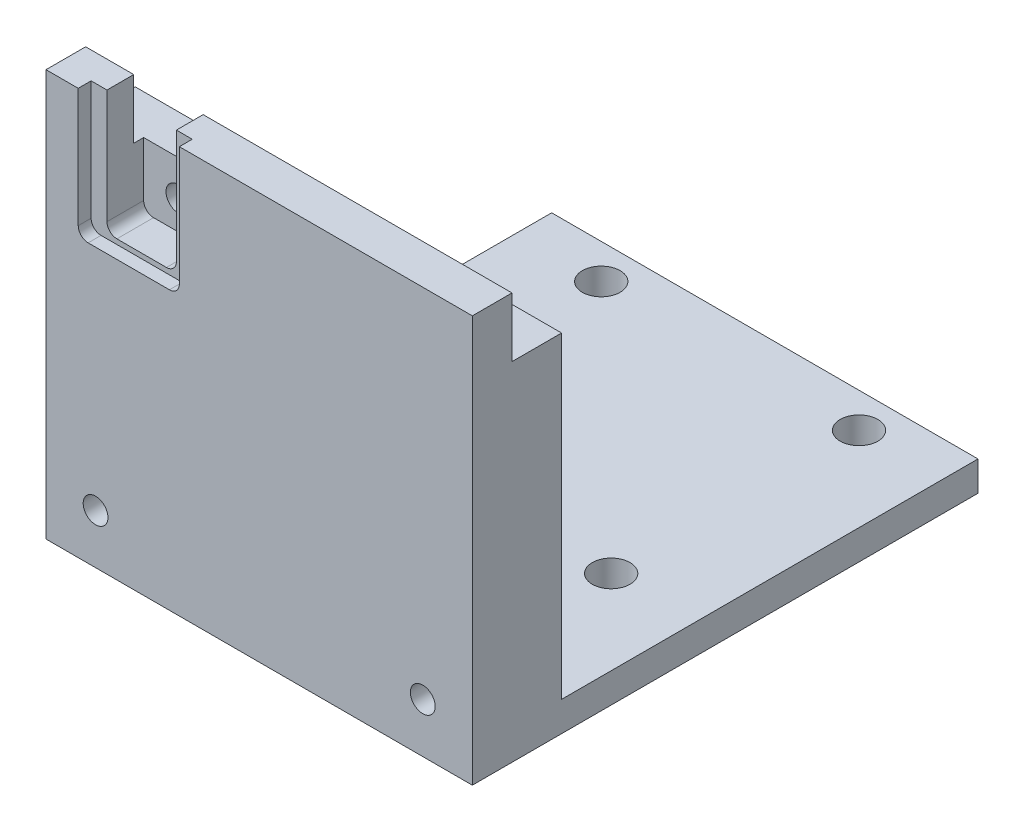
ISO-10303-21;
HEADER;
FILE_DESCRIPTION(('STEP AP214'),'2;1');
FILE_NAME('part.step','',(''),(''),'','','');
FILE_SCHEMA(('AUTOMOTIVE_DESIGN { 1 0 10303 214 1 1 1 1 }'));
ENDSEC;
DATA;
#1=APPLICATION_CONTEXT('core data for automotive mechanical design processes');
#2=APPLICATION_PROTOCOL_DEFINITION('international standard','automotive_design',2000,#1);
#3=PRODUCT_CONTEXT('',#1,'mechanical');
#4=PRODUCT('Part','Part','',(#3));
#5=PRODUCT_RELATED_PRODUCT_CATEGORY('part','',(#4));
#6=PRODUCT_DEFINITION_FORMATION('','',#4);
#7=PRODUCT_DEFINITION_CONTEXT('part definition',#1,'design');
#8=PRODUCT_DEFINITION('design','',#6,#7);
#9=PRODUCT_DEFINITION_SHAPE('','',#8);
#10=(LENGTH_UNIT() NAMED_UNIT(*) SI_UNIT(.MILLI.,.METRE.));
#11=(NAMED_UNIT(*) PLANE_ANGLE_UNIT() SI_UNIT($,.RADIAN.));
#12=(NAMED_UNIT(*) SI_UNIT($,.STERADIAN.) SOLID_ANGLE_UNIT());
#13=UNCERTAINTY_MEASURE_WITH_UNIT(LENGTH_MEASURE(1.E-05),#10,'distance_accuracy_value','');
#14=(GEOMETRIC_REPRESENTATION_CONTEXT(3) GLOBAL_UNCERTAINTY_ASSIGNED_CONTEXT((#13)) GLOBAL_UNIT_ASSIGNED_CONTEXT((#10,
#11,#12)) REPRESENTATION_CONTEXT('',''));
#15=CARTESIAN_POINT('',(0.,0.,0.));
#16=DIRECTION('',(0.,0.,1.));
#17=DIRECTION('',(1.,0.,0.));
#18=AXIS2_PLACEMENT_3D('',#15,#16,#17);
#19=CARTESIAN_POINT('',(-21.5,19.,9.));
#20=DIRECTION('',(0.,-1.,0.));
#21=DIRECTION('',(0.,0.,-1.));
#22=AXIS2_PLACEMENT_3D('',#19,#20,#21);
#23=PLANE('',#22);
#24=DIRECTION('',(-1.,0.,0.));
#25=VECTOR('',#24,1.);
#26=CARTESIAN_POINT('',(-8.05000000000001,19.,7.7));
#27=LINE('',#26,#25);
#28=CARTESIAN_POINT('',(-16.65,19.,7.7));
#29=VERTEX_POINT('',#28);
#30=CARTESIAN_POINT('',(-18.25,19.,7.7));
#31=VERTEX_POINT('',#30);
#32=EDGE_CURVE('E222',#29,#31,#27,.T.);
#33=ORIENTED_EDGE('',*,*,#32,.F.);
#34=DIRECTION('',(0.,0.,1.));
#35=VECTOR('',#34,1.);
#36=CARTESIAN_POINT('',(-16.65,19.,4.));
#37=LINE('',#36,#35);
#38=CARTESIAN_POINT('',(-16.65,19.,5.));
#39=VERTEX_POINT('',#38);
#40=EDGE_CURVE('E213',#39,#29,#37,.T.);
#41=ORIENTED_EDGE('',*,*,#40,.F.);
#42=DIRECTION('',(-1.,0.,0.));
#43=VECTOR('',#42,1.);
#44=CARTESIAN_POINT('',(21.5,19.,5.));
#45=LINE('',#44,#43);
#46=CARTESIAN_POINT('',(-21.5,19.,5.));
#47=VERTEX_POINT('',#46);
#48=EDGE_CURVE('E301',#39,#47,#45,.T.);
#49=ORIENTED_EDGE('',*,*,#48,.T.);
#50=DIRECTION('',(0.,0.,-1.));
#51=VECTOR('',#50,1.);
#52=CARTESIAN_POINT('',(-21.5,19.,9.));
#53=LINE('',#52,#51);
#54=CARTESIAN_POINT('',(-21.5,19.,9.));
#55=VERTEX_POINT('',#54);
#56=EDGE_CURVE('E400',#55,#47,#53,.T.);
#57=ORIENTED_EDGE('',*,*,#56,.F.);
#58=DIRECTION('',(-1.,0.,0.));
#59=VECTOR('',#58,1.);
#60=CARTESIAN_POINT('',(-21.5,19.,9.));
#61=LINE('',#60,#59);
#62=CARTESIAN_POINT('',(-18.25,19.,9.));
#63=VERTEX_POINT('',#62);
#64=EDGE_CURVE('E391',#63,#55,#61,.T.);
#65=ORIENTED_EDGE('',*,*,#64,.F.);
#66=DIRECTION('',(0.,0.,1.));
#67=VECTOR('',#66,1.);
#68=CARTESIAN_POINT('',(-18.25,19.,7.7));
#69=LINE('',#68,#67);
#70=EDGE_CURVE('E246',#31,#63,#69,.T.);
#71=ORIENTED_EDGE('',*,*,#70,.F.);
#72=EDGE_LOOP('',(#33,#41,#49,#57,#65,#71));
#73=FACE_BOUND('',#72,.T.);
#74=ADVANCED_FACE('F41',(#73),#23,.F.);
#75=CARTESIAN_POINT('',(21.5,19.,5.));
#76=DIRECTION('',(0.,0.,1.));
#77=DIRECTION('',(0.,-1.,0.));
#78=AXIS2_PLACEMENT_3D('',#75,#76,#77);
#79=PLANE('',#78);
#80=ORIENTED_EDGE('',*,*,#48,.F.);
#81=DIRECTION('',(0.,-1.,0.));
#82=VECTOR('',#81,1.);
#83=CARTESIAN_POINT('',(-16.65,19.,5.));
#84=LINE('',#83,#82);
#85=CARTESIAN_POINT('',(-16.65,13.,5.));
#86=VERTEX_POINT('',#85);
#87=EDGE_CURVE('E238',#39,#86,#84,.T.);
#88=ORIENTED_EDGE('',*,*,#87,.T.);
#89=DIRECTION('',(-1.,0.,0.));
#90=VECTOR('',#89,1.);
#91=CARTESIAN_POINT('',(21.5,13.,5.));
#92=LINE('',#91,#90);
#93=CARTESIAN_POINT('',(-21.5,13.,5.));
#94=VERTEX_POINT('',#93);
#95=EDGE_CURVE('E313',#86,#94,#92,.T.);
#96=ORIENTED_EDGE('',*,*,#95,.T.);
#97=DIRECTION('',(0.,1.,0.));
#98=VECTOR('',#97,1.);
#99=CARTESIAN_POINT('',(-21.5,19.,5.));
#100=LINE('',#99,#98);
#101=EDGE_CURVE('E280',#94,#47,#100,.T.);
#102=ORIENTED_EDGE('',*,*,#101,.T.);
#103=EDGE_LOOP('',(#80,#88,#96,#102));
#104=FACE_BOUND('',#103,.T.);
#105=ADVANCED_FACE('F511',(#104),#79,.F.);
#106=CARTESIAN_POINT('',(21.5,19.,9.));
#107=DIRECTION('',(-1.,0.,0.));
#108=DIRECTION('',(0.,-1.,0.));
#109=AXIS2_PLACEMENT_3D('',#106,#107,#108);
#110=PLANE('',#109);
#111=DIRECTION('',(0.,0.,1.));
#112=VECTOR('',#111,1.);
#113=CARTESIAN_POINT('',(21.5,13.,5.));
#114=LINE('',#113,#112);
#115=CARTESIAN_POINT('',(21.5,13.,0.));
#116=VERTEX_POINT('',#115);
#117=CARTESIAN_POINT('',(21.5,13.,5.));
#118=VERTEX_POINT('',#117);
#119=EDGE_CURVE('E296',#116,#118,#114,.T.);
#120=ORIENTED_EDGE('',*,*,#119,.T.);
#121=DIRECTION('',(0.,1.,0.));
#122=VECTOR('',#121,1.);
#123=CARTESIAN_POINT('',(21.5,19.,5.));
#124=LINE('',#123,#122);
#125=CARTESIAN_POINT('',(21.5,19.,5.));
#126=VERTEX_POINT('',#125);
#127=EDGE_CURVE('E292',#118,#126,#124,.T.);
#128=ORIENTED_EDGE('',*,*,#127,.T.);
#129=DIRECTION('',(0.,0.,-1.));
#130=VECTOR('',#129,1.);
#131=CARTESIAN_POINT('',(21.5,19.,9.));
#132=LINE('',#131,#130);
#133=CARTESIAN_POINT('',(21.5,19.,9.));
#134=VERTEX_POINT('',#133);
#135=EDGE_CURVE('E413',#134,#126,#132,.T.);
#136=ORIENTED_EDGE('',*,*,#135,.F.);
#137=DIRECTION('',(0.,1.,0.));
#138=VECTOR('',#137,1.);
#139=CARTESIAN_POINT('',(21.5,19.,9.));
#140=LINE('',#139,#138);
#141=CARTESIAN_POINT('',(21.5,-22.,9.));
#142=VERTEX_POINT('',#141);
#143=EDGE_CURVE('E387',#142,#134,#140,.T.);
#144=ORIENTED_EDGE('',*,*,#143,.F.);
#145=DIRECTION('',(0.,0.,1.));
#146=VECTOR('',#145,1.);
#147=CARTESIAN_POINT('',(21.5,-22.,-42.));
#148=LINE('',#147,#146);
#149=CARTESIAN_POINT('',(21.5,-22.,-42.));
#150=VERTEX_POINT('',#149);
#151=EDGE_CURVE('E380',#150,#142,#148,.T.);
#152=ORIENTED_EDGE('',*,*,#151,.F.);
#153=DIRECTION('',(0.,1.,0.));
#154=VECTOR('',#153,1.);
#155=CARTESIAN_POINT('',(21.5,-19.,-42.));
#156=LINE('',#155,#154);
#157=CARTESIAN_POINT('',(21.5,-19.,-42.));
#158=VERTEX_POINT('',#157);
#159=EDGE_CURVE('E359',#150,#158,#156,.T.);
#160=ORIENTED_EDGE('',*,*,#159,.T.);
#161=DIRECTION('',(0.,0.,1.));
#162=VECTOR('',#161,1.);
#163=CARTESIAN_POINT('',(21.5,-19.,-42.));
#164=LINE('',#163,#162);
#165=CARTESIAN_POINT('',(21.5,-19.,0.));
#166=VERTEX_POINT('',#165);
#167=EDGE_CURVE('E376',#158,#166,#164,.T.);
#168=ORIENTED_EDGE('',*,*,#167,.T.);
#169=DIRECTION('',(0.,1.,0.));
#170=VECTOR('',#169,1.);
#171=CARTESIAN_POINT('',(21.5,19.,0.));
#172=LINE('',#171,#170);
#173=EDGE_CURVE('E375',#166,#116,#172,.T.);
#174=ORIENTED_EDGE('',*,*,#173,.T.);
#175=EDGE_LOOP('',(#120,#128,#136,#144,#152,#160,#168,#174));
#176=FACE_BOUND('',#175,.T.);
#177=ADVANCED_FACE('F490',(#176),#110,.F.);
#178=CARTESIAN_POINT('',(-9.65000000000001,19.,5.));
#179=VERTEX_POINT('',#178);
#180=EDGE_CURVE('E211',#126,#179,#45,.T.);
#181=ORIENTED_EDGE('',*,*,#180,.T.);
#182=DIRECTION('',(0.,0.,1.));
#183=VECTOR('',#182,1.);
#184=CARTESIAN_POINT('',(-9.65000000000001,19.,4.));
#185=LINE('',#184,#183);
#186=CARTESIAN_POINT('',(-9.65000000000001,19.,7.7));
#187=VERTEX_POINT('',#186);
#188=EDGE_CURVE('E195',#179,#187,#185,.T.);
#189=ORIENTED_EDGE('',*,*,#188,.T.);
#190=CARTESIAN_POINT('',(-8.05000000000001,19.,7.7));
#191=VERTEX_POINT('',#190);
#192=EDGE_CURVE('E209',#191,#187,#27,.T.);
#193=ORIENTED_EDGE('',*,*,#192,.F.);
#194=DIRECTION('',(0.,0.,1.));
#195=VECTOR('',#194,1.);
#196=CARTESIAN_POINT('',(-8.05000000000001,19.,7.7));
#197=LINE('',#196,#195);
#198=CARTESIAN_POINT('',(-8.05000000000001,19.,9.));
#199=VERTEX_POINT('',#198);
#200=EDGE_CURVE('E233',#191,#199,#197,.T.);
#201=ORIENTED_EDGE('',*,*,#200,.T.);
#202=EDGE_CURVE('E393',#134,#199,#61,.T.);
#203=ORIENTED_EDGE('',*,*,#202,.F.);
#204=ORIENTED_EDGE('',*,*,#135,.T.);
#205=EDGE_LOOP('',(#181,#189,#193,#201,#203,#204));
#206=FACE_BOUND('',#205,.T.);
#207=ADVANCED_FACE('F207',(#206),#23,.F.);
#208=CARTESIAN_POINT('',(-21.5,19.,9.));
#209=DIRECTION('',(1.,0.,0.));
#210=DIRECTION('',(0.,1.,0.));
#211=AXIS2_PLACEMENT_3D('',#208,#209,#210);
#212=PLANE('',#211);
#213=ORIENTED_EDGE('',*,*,#56,.T.);
#214=ORIENTED_EDGE('',*,*,#101,.F.);
#215=DIRECTION('',(0.,0.,1.));
#216=VECTOR('',#215,1.);
#217=CARTESIAN_POINT('',(-21.5,13.,5.));
#218=LINE('',#217,#216);
#219=CARTESIAN_POINT('',(-21.5,13.,0.));
#220=VERTEX_POINT('',#219);
#221=EDGE_CURVE('E297',#220,#94,#218,.T.);
#222=ORIENTED_EDGE('',*,*,#221,.F.);
#223=DIRECTION('',(0.,-1.,0.));
#224=VECTOR('',#223,1.);
#225=CARTESIAN_POINT('',(-21.5,19.,0.));
#226=LINE('',#225,#224);
#227=CARTESIAN_POINT('',(-21.5,-19.,0.));
#228=VERTEX_POINT('',#227);
#229=EDGE_CURVE('E404',#220,#228,#226,.T.);
#230=ORIENTED_EDGE('',*,*,#229,.T.);
#231=DIRECTION('',(0.,0.,1.));
#232=VECTOR('',#231,1.);
#233=CARTESIAN_POINT('',(-21.5,-19.,-42.));
#234=LINE('',#233,#232);
#235=CARTESIAN_POINT('',(-21.5,-19.,-42.));
#236=VERTEX_POINT('',#235);
#237=EDGE_CURVE('E371',#236,#228,#234,.T.);
#238=ORIENTED_EDGE('',*,*,#237,.F.);
#239=DIRECTION('',(0.,-1.,0.));
#240=VECTOR('',#239,1.);
#241=CARTESIAN_POINT('',(-21.5,-19.,-42.));
#242=LINE('',#241,#240);
#243=CARTESIAN_POINT('',(-21.5,-22.,-42.));
#244=VERTEX_POINT('',#243);
#245=EDGE_CURVE('E351',#236,#244,#242,.T.);
#246=ORIENTED_EDGE('',*,*,#245,.T.);
#247=DIRECTION('',(0.,0.,1.));
#248=VECTOR('',#247,1.);
#249=CARTESIAN_POINT('',(-21.5,-22.,-42.));
#250=LINE('',#249,#248);
#251=CARTESIAN_POINT('',(-21.5,-22.,9.));
#252=VERTEX_POINT('',#251);
#253=EDGE_CURVE('E367',#244,#252,#250,.T.);
#254=ORIENTED_EDGE('',*,*,#253,.T.);
#255=DIRECTION('',(0.,-1.,0.));
#256=VECTOR('',#255,1.);
#257=CARTESIAN_POINT('',(-21.5,19.,9.));
#258=LINE('',#257,#256);
#259=EDGE_CURVE('E397',#55,#252,#258,.T.);
#260=ORIENTED_EDGE('',*,*,#259,.F.);
#261=EDGE_LOOP('',(#213,#214,#222,#230,#238,#246,#254,#260));
#262=FACE_BOUND('',#261,.T.);
#263=ADVANCED_FACE('F526',(#262),#212,.F.);
#264=CARTESIAN_POINT('',(0.,0.,9.));
#265=DIRECTION('',(0.,0.,1.));
#266=DIRECTION('',(1.,0.,0.));
#267=AXIS2_PLACEMENT_3D('',#264,#265,#266);
#268=PLANE('',#267);
#269=DIRECTION('',(0.,1.,0.));
#270=VECTOR('',#269,1.);
#271=CARTESIAN_POINT('',(-8.05000000000001,19.,9.));
#272=LINE('',#271,#270);
#273=CARTESIAN_POINT('',(-8.05000000000001,7.00000000000001,9.));
#274=VERTEX_POINT('',#273);
#275=EDGE_CURVE('E234',#274,#199,#272,.T.);
#276=ORIENTED_EDGE('',*,*,#275,.F.);
#277=CARTESIAN_POINT('',(-9.05000000000001,7.00000000000001,9.));
#278=DIRECTION('',(0.,0.,1.));
#279=DIRECTION('',(1.,0.,0.));
#280=AXIS2_PLACEMENT_3D('',#277,#278,#279);
#281=CIRCLE('',#280,1.);
#282=CARTESIAN_POINT('',(-9.05000000000001,6.00000000000001,9.));
#283=VERTEX_POINT('',#282);
#284=EDGE_CURVE('E11',#274,#283,#281,.F.);
#285=ORIENTED_EDGE('',*,*,#284,.T.);
#286=DIRECTION('',(1.,0.,0.));
#287=VECTOR('',#286,1.);
#288=CARTESIAN_POINT('',(-8.05000000000001,6.00000000000001,9.));
#289=LINE('',#288,#287);
#290=CARTESIAN_POINT('',(-17.25,6.,9.));
#291=VERTEX_POINT('',#290);
#292=EDGE_CURVE('E242',#291,#283,#289,.T.);
#293=ORIENTED_EDGE('',*,*,#292,.F.);
#294=CARTESIAN_POINT('',(-17.25,7.,9.));
#295=DIRECTION('',(0.,0.,1.));
#296=DIRECTION('',(1.,0.,0.));
#297=AXIS2_PLACEMENT_3D('',#294,#295,#296);
#298=CIRCLE('',#297,1.);
#299=CARTESIAN_POINT('',(-18.25,7.,9.));
#300=VERTEX_POINT('',#299);
#301=EDGE_CURVE('E50',#291,#300,#298,.F.);
#302=ORIENTED_EDGE('',*,*,#301,.T.);
#303=DIRECTION('',(0.,-1.,0.));
#304=VECTOR('',#303,1.);
#305=CARTESIAN_POINT('',(-18.25,19.,9.));
#306=LINE('',#305,#304);
#307=EDGE_CURVE('E237',#63,#300,#306,.T.);
#308=ORIENTED_EDGE('',*,*,#307,.F.);
#309=ORIENTED_EDGE('',*,*,#64,.T.);
#310=ORIENTED_EDGE('',*,*,#259,.T.);
#311=DIRECTION('',(1.,0.,0.));
#312=VECTOR('',#311,1.);
#313=CARTESIAN_POINT('',(-21.5,-22.,9.));
#314=LINE('',#313,#312);
#315=EDGE_CURVE('E350',#252,#142,#314,.T.);
#316=ORIENTED_EDGE('',*,*,#315,.T.);
#317=ORIENTED_EDGE('',*,*,#143,.T.);
#318=ORIENTED_EDGE('',*,*,#202,.T.);
#319=EDGE_LOOP('',(#276,#285,#293,#302,#308,#309,#310,#316,#317,#318));
#320=FACE_BOUND('',#319,.T.);
#321=CARTESIAN_POINT('',(16.5,-17.,9.));
#322=DIRECTION('',(0.,0.,1.));
#323=DIRECTION('',(1.,0.,0.));
#324=AXIS2_PLACEMENT_3D('',#321,#322,#323);
#325=CIRCLE('',#324,1.25);
#326=CARTESIAN_POINT('',(17.75,-17.,9.));
#327=VERTEX_POINT('',#326);
#328=EDGE_CURVE('E281',#327,#327,#325,.T.);
#329=ORIENTED_EDGE('',*,*,#328,.F.);
#330=EDGE_LOOP('',(#329));
#331=FACE_BOUND('',#330,.T.);
#332=CARTESIAN_POINT('',(-16.5,-17.0000000000002,9.));
#333=DIRECTION('',(0.,0.,1.));
#334=DIRECTION('',(1.,0.,0.));
#335=AXIS2_PLACEMENT_3D('',#332,#333,#334);
#336=CIRCLE('',#335,1.25);
#337=CARTESIAN_POINT('',(-15.25,-17.0000000000002,9.));
#338=VERTEX_POINT('',#337);
#339=EDGE_CURVE('E256',#338,#338,#336,.T.);
#340=ORIENTED_EDGE('',*,*,#339,.F.);
#341=EDGE_LOOP('',(#340));
#342=FACE_BOUND('',#341,.T.);
#343=ADVANCED_FACE('F471',(#320,#331,#342),#268,.T.);
#344=CARTESIAN_POINT('',(0.,0.,0.));
#345=DIRECTION('',(0.,0.,1.));
#346=DIRECTION('',(1.,0.,0.));
#347=AXIS2_PLACEMENT_3D('',#344,#345,#346);
#348=PLANE('',#347);
#349=CARTESIAN_POINT('',(-13.1499950439402,9.39999999999639,0.));
#350=DIRECTION('',(0.,0.,1.));
#351=DIRECTION('',(1.,0.,0.));
#352=AXIS2_PLACEMENT_3D('',#349,#350,#351);
#353=CIRCLE('',#352,1.25);
#354=CARTESIAN_POINT('',(-11.8999950439402,9.39999999999639,0.));
#355=VERTEX_POINT('',#354);
#356=EDGE_CURVE('E424',#355,#355,#353,.T.);
#357=ORIENTED_EDGE('',*,*,#356,.T.);
#358=EDGE_LOOP('',(#357));
#359=FACE_BOUND('',#358,.T.);
#360=CARTESIAN_POINT('',(16.5,-17.,0.));
#361=DIRECTION('',(0.,0.,1.));
#362=DIRECTION('',(1.,0.,0.));
#363=AXIS2_PLACEMENT_3D('',#360,#361,#362);
#364=CIRCLE('',#363,1.25);
#365=CARTESIAN_POINT('',(17.75,-17.,0.));
#366=VERTEX_POINT('',#365);
#367=EDGE_CURVE('E276',#366,#366,#364,.T.);
#368=ORIENTED_EDGE('',*,*,#367,.T.);
#369=EDGE_LOOP('',(#368));
#370=FACE_BOUND('',#369,.T.);
#371=CARTESIAN_POINT('',(-16.5,-17.0000000000002,0.));
#372=DIRECTION('',(0.,0.,1.));
#373=DIRECTION('',(1.,0.,0.));
#374=AXIS2_PLACEMENT_3D('',#371,#372,#373);
#375=CIRCLE('',#374,1.25);
#376=CARTESIAN_POINT('',(-15.25,-17.0000000000002,0.));
#377=VERTEX_POINT('',#376);
#378=EDGE_CURVE('E285',#377,#377,#375,.T.);
#379=ORIENTED_EDGE('',*,*,#378,.T.);
#380=EDGE_LOOP('',(#379));
#381=FACE_BOUND('',#380,.T.);
#382=ORIENTED_EDGE('',*,*,#229,.F.);
#383=DIRECTION('',(-1.,0.,0.));
#384=VECTOR('',#383,1.);
#385=CARTESIAN_POINT('',(21.5,13.,0.));
#386=LINE('',#385,#384);
#387=EDGE_CURVE('E314',#116,#220,#386,.T.);
#388=ORIENTED_EDGE('',*,*,#387,.F.);
#389=ORIENTED_EDGE('',*,*,#173,.F.);
#390=DIRECTION('',(1.,0.,0.));
#391=VECTOR('',#390,1.);
#392=CARTESIAN_POINT('',(-21.5,-19.,0.));
#393=LINE('',#392,#391);
#394=EDGE_CURVE('E392',#228,#166,#393,.T.);
#395=ORIENTED_EDGE('',*,*,#394,.F.);
#396=EDGE_LOOP('',(#382,#388,#389,#395));
#397=FACE_BOUND('',#396,.T.);
#398=ADVANCED_FACE('F639',(#359,#370,#381,#397),#348,.F.);
#399=CARTESIAN_POINT('',(-21.5,-19.,-42.));
#400=DIRECTION('',(0.,1.,0.));
#401=DIRECTION('',(0.,0.,1.));
#402=AXIS2_PLACEMENT_3D('',#399,#400,#401);
#403=PLANE('',#402);
#404=CARTESIAN_POINT('',(-13.0000000000001,-19.,-13.5));
#405=DIRECTION('',(0.,1.,0.));
#406=DIRECTION('',(0.,0.,1.));
#407=AXIS2_PLACEMENT_3D('',#404,#405,#406);
#408=CIRCLE('',#407,1.90073333630419);
#409=CARTESIAN_POINT('',(-13.0000000000001,-19.,-11.5992666636958));
#410=VERTEX_POINT('',#409);
#411=EDGE_CURVE('E346',#410,#410,#408,.T.);
#412=ORIENTED_EDGE('',*,*,#411,.F.);
#413=EDGE_LOOP('',(#412));
#414=FACE_BOUND('',#413,.T.);
#415=CARTESIAN_POINT('',(12.9999999999999,-19.,-13.5));
#416=DIRECTION('',(0.,1.,0.));
#417=DIRECTION('',(0.,0.,1.));
#418=AXIS2_PLACEMENT_3D('',#415,#416,#417);
#419=CIRCLE('',#418,1.90073333630419);
#420=CARTESIAN_POINT('',(12.9999999999999,-19.,-11.5992666636958));
#421=VERTEX_POINT('',#420);
#422=EDGE_CURVE('E342',#421,#421,#419,.T.);
#423=ORIENTED_EDGE('',*,*,#422,.F.);
#424=EDGE_LOOP('',(#423));
#425=FACE_BOUND('',#424,.T.);
#426=CARTESIAN_POINT('',(13.,-19.,-38.5));
#427=DIRECTION('',(0.,1.,0.));
#428=DIRECTION('',(0.,0.,1.));
#429=AXIS2_PLACEMENT_3D('',#426,#427,#428);
#430=CIRCLE('',#429,1.9007333363042);
#431=CARTESIAN_POINT('',(13.,-19.,-36.5992666636958));
#432=VERTEX_POINT('',#431);
#433=EDGE_CURVE('E338',#432,#432,#430,.T.);
#434=ORIENTED_EDGE('',*,*,#433,.F.);
#435=EDGE_LOOP('',(#434));
#436=FACE_BOUND('',#435,.T.);
#437=CARTESIAN_POINT('',(-13.,-19.,-38.5));
#438=DIRECTION('',(0.,1.,0.));
#439=DIRECTION('',(0.,0.,1.));
#440=AXIS2_PLACEMENT_3D('',#437,#438,#439);
#441=CIRCLE('',#440,1.9007333363042);
#442=CARTESIAN_POINT('',(-13.,-19.,-36.5992666636958));
#443=VERTEX_POINT('',#442);
#444=EDGE_CURVE('E334',#443,#443,#441,.T.);
#445=ORIENTED_EDGE('',*,*,#444,.F.);
#446=EDGE_LOOP('',(#445));
#447=FACE_BOUND('',#446,.T.);
#448=ORIENTED_EDGE('',*,*,#237,.T.);
#449=ORIENTED_EDGE('',*,*,#394,.T.);
#450=ORIENTED_EDGE('',*,*,#167,.F.);
#451=DIRECTION('',(-1.,0.,0.));
#452=VECTOR('',#451,1.);
#453=CARTESIAN_POINT('',(-21.5,-19.,-42.));
#454=LINE('',#453,#452);
#455=EDGE_CURVE('E363',#158,#236,#454,.T.);
#456=ORIENTED_EDGE('',*,*,#455,.T.);
#457=EDGE_LOOP('',(#448,#449,#450,#456));
#458=FACE_BOUND('',#457,.T.);
#459=ADVANCED_FACE('F696',(#414,#425,#436,#447,#458),#403,.T.);
#460=CARTESIAN_POINT('',(-21.5,-22.,-42.));
#461=DIRECTION('',(0.,-1.,0.));
#462=DIRECTION('',(0.,0.,-1.));
#463=AXIS2_PLACEMENT_3D('',#460,#461,#462);
#464=PLANE('',#463);
#465=CARTESIAN_POINT('',(-13.0000000000001,-22.,-13.5));
#466=DIRECTION('',(0.,-1.,0.));
#467=DIRECTION('',(0.,0.,-1.));
#468=AXIS2_PLACEMENT_3D('',#465,#466,#467);
#469=CIRCLE('',#468,1.90073333630419);
#470=CARTESIAN_POINT('',(-13.0000000000001,-22.,-15.4007333363042));
#471=VERTEX_POINT('',#470);
#472=EDGE_CURVE('E312',#471,#471,#469,.T.);
#473=ORIENTED_EDGE('',*,*,#472,.F.);
#474=EDGE_LOOP('',(#473));
#475=FACE_BOUND('',#474,.T.);
#476=CARTESIAN_POINT('',(12.9999999999999,-22.,-13.5));
#477=DIRECTION('',(0.,-1.,0.));
#478=DIRECTION('',(0.,0.,-1.));
#479=AXIS2_PLACEMENT_3D('',#476,#477,#478);
#480=CIRCLE('',#479,1.90073333630419);
#481=CARTESIAN_POINT('',(12.9999999999999,-22.,-15.4007333363042));
#482=VERTEX_POINT('',#481);
#483=EDGE_CURVE('E324',#482,#482,#480,.T.);
#484=ORIENTED_EDGE('',*,*,#483,.F.);
#485=EDGE_LOOP('',(#484));
#486=FACE_BOUND('',#485,.T.);
#487=CARTESIAN_POINT('',(13.,-22.,-38.5));
#488=DIRECTION('',(0.,-1.,0.));
#489=DIRECTION('',(0.,0.,-1.));
#490=AXIS2_PLACEMENT_3D('',#487,#488,#489);
#491=CIRCLE('',#490,1.9007333363042);
#492=CARTESIAN_POINT('',(13.,-22.,-40.4007333363042));
#493=VERTEX_POINT('',#492);
#494=EDGE_CURVE('E319',#493,#493,#491,.T.);
#495=ORIENTED_EDGE('',*,*,#494,.F.);
#496=EDGE_LOOP('',(#495));
#497=FACE_BOUND('',#496,.T.);
#498=CARTESIAN_POINT('',(-13.,-22.,-38.5));
#499=DIRECTION('',(0.,-1.,0.));
#500=DIRECTION('',(0.,0.,-1.));
#501=AXIS2_PLACEMENT_3D('',#498,#499,#500);
#502=CIRCLE('',#501,1.9007333363042);
#503=CARTESIAN_POINT('',(-13.,-22.,-40.4007333363042));
#504=VERTEX_POINT('',#503);
#505=EDGE_CURVE('E323',#504,#504,#502,.T.);
#506=ORIENTED_EDGE('',*,*,#505,.F.);
#507=EDGE_LOOP('',(#506));
#508=FACE_BOUND('',#507,.T.);
#509=ORIENTED_EDGE('',*,*,#315,.F.);
#510=ORIENTED_EDGE('',*,*,#253,.F.);
#511=DIRECTION('',(1.,0.,0.));
#512=VECTOR('',#511,1.);
#513=CARTESIAN_POINT('',(-21.5,-22.,-42.));
#514=LINE('',#513,#512);
#515=EDGE_CURVE('E355',#244,#150,#514,.T.);
#516=ORIENTED_EDGE('',*,*,#515,.T.);
#517=ORIENTED_EDGE('',*,*,#151,.T.);
#518=EDGE_LOOP('',(#509,#510,#516,#517));
#519=FACE_BOUND('',#518,.T.);
#520=ADVANCED_FACE('F867',(#475,#486,#497,#508,#519),#464,.T.);
#521=CARTESIAN_POINT('',(0.,0.,-42.));
#522=DIRECTION('',(0.,0.,1.));
#523=DIRECTION('',(1.,0.,0.));
#524=AXIS2_PLACEMENT_3D('',#521,#522,#523);
#525=PLANE('',#524);
#526=ORIENTED_EDGE('',*,*,#245,.F.);
#527=ORIENTED_EDGE('',*,*,#455,.F.);
#528=ORIENTED_EDGE('',*,*,#159,.F.);
#529=ORIENTED_EDGE('',*,*,#515,.F.);
#530=EDGE_LOOP('',(#526,#527,#528,#529));
#531=FACE_BOUND('',#530,.T.);
#532=ADVANCED_FACE('F859',(#531),#525,.F.);
#533=CARTESIAN_POINT('',(-13.,19.,-38.5));
#534=DIRECTION('',(0.,-1.,0.));
#535=DIRECTION('',(0.,0.,-1.));
#536=AXIS2_PLACEMENT_3D('',#533,#534,#535);
#537=CYLINDRICAL_SURFACE('',#536,1.9007333363042);
#538=ORIENTED_EDGE('',*,*,#444,.T.);
#539=EDGE_LOOP('',(#538));
#540=FACE_BOUND('',#539,.T.);
#541=ORIENTED_EDGE('',*,*,#505,.T.);
#542=EDGE_LOOP('',(#541));
#543=FACE_BOUND('',#542,.T.);
#544=ADVANCED_FACE('F849',(#540,#543),#537,.F.);
#545=CARTESIAN_POINT('',(13.,19.,-38.5));
#546=DIRECTION('',(0.,-1.,0.));
#547=DIRECTION('',(0.,0.,-1.));
#548=AXIS2_PLACEMENT_3D('',#545,#546,#547);
#549=CYLINDRICAL_SURFACE('',#548,1.9007333363042);
#550=ORIENTED_EDGE('',*,*,#433,.T.);
#551=EDGE_LOOP('',(#550));
#552=FACE_BOUND('',#551,.T.);
#553=ORIENTED_EDGE('',*,*,#494,.T.);
#554=EDGE_LOOP('',(#553));
#555=FACE_BOUND('',#554,.T.);
#556=ADVANCED_FACE('F839',(#552,#555),#549,.F.);
#557=CARTESIAN_POINT('',(12.9999999999999,19.,-13.5));
#558=DIRECTION('',(0.,-1.,0.));
#559=DIRECTION('',(0.,0.,-1.));
#560=AXIS2_PLACEMENT_3D('',#557,#558,#559);
#561=CYLINDRICAL_SURFACE('',#560,1.90073333630419);
#562=ORIENTED_EDGE('',*,*,#422,.T.);
#563=EDGE_LOOP('',(#562));
#564=FACE_BOUND('',#563,.T.);
#565=ORIENTED_EDGE('',*,*,#483,.T.);
#566=EDGE_LOOP('',(#565));
#567=FACE_BOUND('',#566,.T.);
#568=ADVANCED_FACE('F829',(#564,#567),#561,.F.);
#569=CARTESIAN_POINT('',(-13.0000000000001,19.,-13.5));
#570=DIRECTION('',(0.,-1.,0.));
#571=DIRECTION('',(0.,0.,-1.));
#572=AXIS2_PLACEMENT_3D('',#569,#570,#571);
#573=CYLINDRICAL_SURFACE('',#572,1.90073333630419);
#574=ORIENTED_EDGE('',*,*,#411,.T.);
#575=EDGE_LOOP('',(#574));
#576=FACE_BOUND('',#575,.T.);
#577=ORIENTED_EDGE('',*,*,#472,.T.);
#578=EDGE_LOOP('',(#577));
#579=FACE_BOUND('',#578,.T.);
#580=ADVANCED_FACE('F718',(#576,#579),#573,.F.);
#581=CARTESIAN_POINT('',(-9.65000000000001,13.,5.));
#582=VERTEX_POINT('',#581);
#583=EDGE_CURVE('E308',#118,#582,#92,.T.);
#584=ORIENTED_EDGE('',*,*,#583,.T.);
#585=DIRECTION('',(0.,1.,0.));
#586=VECTOR('',#585,1.);
#587=CARTESIAN_POINT('',(-9.65000000000001,19.,5.));
#588=LINE('',#587,#586);
#589=EDGE_CURVE('E494',#582,#179,#588,.T.);
#590=ORIENTED_EDGE('',*,*,#589,.T.);
#591=ORIENTED_EDGE('',*,*,#180,.F.);
#592=ORIENTED_EDGE('',*,*,#127,.F.);
#593=EDGE_LOOP('',(#584,#590,#591,#592));
#594=FACE_BOUND('',#593,.T.);
#595=ADVANCED_FACE('F493',(#594),#79,.F.);
#596=CARTESIAN_POINT('',(21.5,13.,5.));
#597=DIRECTION('',(0.,-1.,0.));
#598=DIRECTION('',(1.,0.,0.));
#599=AXIS2_PLACEMENT_3D('',#596,#597,#598);
#600=PLANE('',#599);
#601=ORIENTED_EDGE('',*,*,#95,.F.);
#602=DIRECTION('',(0.,0.,-1.));
#603=VECTOR('',#602,1.);
#604=CARTESIAN_POINT('',(-16.65,13.,5.));
#605=LINE('',#604,#603);
#606=CARTESIAN_POINT('',(-16.65,13.,4.));
#607=VERTEX_POINT('',#606);
#608=EDGE_CURVE('E498',#86,#607,#605,.T.);
#609=ORIENTED_EDGE('',*,*,#608,.T.);
#610=DIRECTION('',(1.,0.,0.));
#611=VECTOR('',#610,1.);
#612=CARTESIAN_POINT('',(21.5,13.,4.));
#613=LINE('',#612,#611);
#614=CARTESIAN_POINT('',(-9.65000000000001,13.,4.));
#615=VERTEX_POINT('',#614);
#616=EDGE_CURVE('E416',#607,#615,#613,.T.);
#617=ORIENTED_EDGE('',*,*,#616,.T.);
#618=DIRECTION('',(0.,0.,1.));
#619=VECTOR('',#618,1.);
#620=CARTESIAN_POINT('',(-9.65000000000001,13.,5.));
#621=LINE('',#620,#619);
#622=EDGE_CURVE('E499',#615,#582,#621,.T.);
#623=ORIENTED_EDGE('',*,*,#622,.T.);
#624=ORIENTED_EDGE('',*,*,#583,.F.);
#625=ORIENTED_EDGE('',*,*,#119,.F.);
#626=ORIENTED_EDGE('',*,*,#387,.T.);
#627=ORIENTED_EDGE('',*,*,#221,.T.);
#628=EDGE_LOOP('',(#601,#609,#617,#623,#624,#625,#626,#627));
#629=FACE_BOUND('',#628,.T.);
#630=CARTESIAN_POINT('',(16.5,13.,2.5));
#631=DIRECTION('',(0.,1.,0.));
#632=DIRECTION('',(0.,0.,1.));
#633=AXIS2_PLACEMENT_3D('',#630,#631,#632);
#634=CIRCLE('',#633,1.2);
#635=CARTESIAN_POINT('',(16.5,13.,3.70000000000001));
#636=VERTEX_POINT('',#635);
#637=EDGE_CURVE('E257',#636,#636,#634,.T.);
#638=ORIENTED_EDGE('',*,*,#637,.F.);
#639=EDGE_LOOP('',(#638));
#640=FACE_BOUND('',#639,.T.);
#641=CARTESIAN_POINT('',(6.49999999999998,13.,2.50000000000021));
#642=DIRECTION('',(0.,1.,0.));
#643=DIRECTION('',(0.,0.,1.));
#644=AXIS2_PLACEMENT_3D('',#641,#642,#643);
#645=CIRCLE('',#644,1.2);
#646=CARTESIAN_POINT('',(6.49999999999998,13.,3.70000000000022));
#647=VERTEX_POINT('',#646);
#648=EDGE_CURVE('E265',#647,#647,#645,.T.);
#649=ORIENTED_EDGE('',*,*,#648,.F.);
#650=EDGE_LOOP('',(#649));
#651=FACE_BOUND('',#650,.T.);
#652=CARTESIAN_POINT('',(-3.50000000000002,13.,2.50000000000042));
#653=DIRECTION('',(0.,1.,0.));
#654=DIRECTION('',(0.,0.,1.));
#655=AXIS2_PLACEMENT_3D('',#652,#653,#654);
#656=CIRCLE('',#655,1.2);
#657=CARTESIAN_POINT('',(-3.50000000000002,13.,3.70000000000042));
#658=VERTEX_POINT('',#657);
#659=EDGE_CURVE('E249',#658,#658,#656,.T.);
#660=ORIENTED_EDGE('',*,*,#659,.F.);
#661=EDGE_LOOP('',(#660));
#662=FACE_BOUND('',#661,.T.);
#663=ADVANCED_FACE('F515',(#629,#640,#651,#662),#600,.F.);
#664=CARTESIAN_POINT('',(-16.5,-17.0000000000002,0.));
#665=DIRECTION('',(0.,0.,1.));
#666=DIRECTION('',(1.,0.,0.));
#667=AXIS2_PLACEMENT_3D('',#664,#665,#666);
#668=CYLINDRICAL_SURFACE('',#667,1.25);
#669=ORIENTED_EDGE('',*,*,#378,.F.);
#670=EDGE_LOOP('',(#669));
#671=FACE_BOUND('',#670,.T.);
#672=ORIENTED_EDGE('',*,*,#339,.T.);
#673=EDGE_LOOP('',(#672));
#674=FACE_BOUND('',#673,.T.);
#675=ADVANCED_FACE('F708',(#671,#674),#668,.F.);
#676=CARTESIAN_POINT('',(16.5,-17.,0.));
#677=DIRECTION('',(0.,0.,1.));
#678=DIRECTION('',(1.,0.,0.));
#679=AXIS2_PLACEMENT_3D('',#676,#677,#678);
#680=CYLINDRICAL_SURFACE('',#679,1.25);
#681=ORIENTED_EDGE('',*,*,#367,.F.);
#682=EDGE_LOOP('',(#681));
#683=FACE_BOUND('',#682,.T.);
#684=ORIENTED_EDGE('',*,*,#328,.T.);
#685=EDGE_LOOP('',(#684));
#686=FACE_BOUND('',#685,.T.);
#687=ADVANCED_FACE('F794',(#683,#686),#680,.F.);
#688=CARTESIAN_POINT('',(-3.50000000000001,-1.99999999999999,2.50000000000043));
#689=DIRECTION('',(0.,1.,0.));
#690=DIRECTION('',(0.,0.,1.));
#691=AXIS2_PLACEMENT_3D('',#688,#689,#690);
#692=CYLINDRICAL_SURFACE('',#691,1.2);
#693=CARTESIAN_POINT('',(-3.50000000000001,-1.99999999999999,2.50000000000043));
#694=DIRECTION('',(0.,1.,0.));
#695=DIRECTION('',(0.,0.,1.));
#696=AXIS2_PLACEMENT_3D('',#693,#694,#695);
#697=CIRCLE('',#696,1.2);
#698=CARTESIAN_POINT('',(-3.50000000000001,-1.99999999999999,3.70000000000043));
#699=VERTEX_POINT('',#698);
#700=EDGE_CURVE('E269',#699,#699,#697,.T.);
#701=ORIENTED_EDGE('',*,*,#700,.F.);
#702=EDGE_LOOP('',(#701));
#703=FACE_BOUND('',#702,.T.);
#704=ORIENTED_EDGE('',*,*,#659,.T.);
#705=EDGE_LOOP('',(#704));
#706=FACE_BOUND('',#705,.T.);
#707=ADVANCED_FACE('F784',(#703,#706),#692,.F.);
#708=CARTESIAN_POINT('',(-3.50000000000001,-1.99999999999999,2.50000000000043));
#709=DIRECTION('',(0.,1.,0.));
#710=DIRECTION('',(0.,0.,1.));
#711=AXIS2_PLACEMENT_3D('',#708,#709,#710);
#712=PLANE('',#711);
#713=ORIENTED_EDGE('',*,*,#700,.T.);
#714=EDGE_LOOP('',(#713));
#715=FACE_BOUND('',#714,.T.);
#716=ADVANCED_FACE('F773',(#715),#712,.T.);
#717=CARTESIAN_POINT('',(6.49999999999999,-1.99999999999999,2.50000000000022));
#718=DIRECTION('',(0.,1.,0.));
#719=DIRECTION('',(0.,0.,1.));
#720=AXIS2_PLACEMENT_3D('',#717,#718,#719);
#721=CYLINDRICAL_SURFACE('',#720,1.2);
#722=CARTESIAN_POINT('',(6.49999999999999,-1.99999999999999,2.50000000000022));
#723=DIRECTION('',(0.,1.,0.));
#724=DIRECTION('',(0.,0.,1.));
#725=AXIS2_PLACEMENT_3D('',#722,#723,#724);
#726=CIRCLE('',#725,1.2);
#727=CARTESIAN_POINT('',(6.49999999999999,-1.99999999999999,3.70000000000023));
#728=VERTEX_POINT('',#727);
#729=EDGE_CURVE('E261',#728,#728,#726,.T.);
#730=ORIENTED_EDGE('',*,*,#729,.F.);
#731=EDGE_LOOP('',(#730));
#732=FACE_BOUND('',#731,.T.);
#733=ORIENTED_EDGE('',*,*,#648,.T.);
#734=EDGE_LOOP('',(#733));
#735=FACE_BOUND('',#734,.T.);
#736=ADVANCED_FACE('F763',(#732,#735),#721,.F.);
#737=CARTESIAN_POINT('',(6.49999999999999,-1.99999999999999,2.50000000000022));
#738=DIRECTION('',(0.,1.,0.));
#739=DIRECTION('',(0.,0.,1.));
#740=AXIS2_PLACEMENT_3D('',#737,#738,#739);
#741=PLANE('',#740);
#742=ORIENTED_EDGE('',*,*,#729,.T.);
#743=EDGE_LOOP('',(#742));
#744=FACE_BOUND('',#743,.T.);
#745=ADVANCED_FACE('F752',(#744),#741,.T.);
#746=CARTESIAN_POINT('',(16.5,-1.99999999999998,2.50000000000002));
#747=DIRECTION('',(0.,1.,0.));
#748=DIRECTION('',(0.,0.,1.));
#749=AXIS2_PLACEMENT_3D('',#746,#747,#748);
#750=CYLINDRICAL_SURFACE('',#749,1.2);
#751=CARTESIAN_POINT('',(16.5,-1.99999999999998,2.50000000000002));
#752=DIRECTION('',(0.,1.,0.));
#753=DIRECTION('',(0.,0.,1.));
#754=AXIS2_PLACEMENT_3D('',#751,#752,#753);
#755=CIRCLE('',#754,1.2);
#756=CARTESIAN_POINT('',(16.5,-1.99999999999998,3.70000000000002));
#757=VERTEX_POINT('',#756);
#758=EDGE_CURVE('E252',#757,#757,#755,.T.);
#759=ORIENTED_EDGE('',*,*,#758,.F.);
#760=EDGE_LOOP('',(#759));
#761=FACE_BOUND('',#760,.T.);
#762=ORIENTED_EDGE('',*,*,#637,.T.);
#763=EDGE_LOOP('',(#762));
#764=FACE_BOUND('',#763,.T.);
#765=ADVANCED_FACE('F741',(#761,#764),#750,.F.);
#766=CARTESIAN_POINT('',(16.5,-1.99999999999998,2.50000000000002));
#767=DIRECTION('',(0.,1.,0.));
#768=DIRECTION('',(0.,0.,1.));
#769=AXIS2_PLACEMENT_3D('',#766,#767,#768);
#770=PLANE('',#769);
#771=ORIENTED_EDGE('',*,*,#758,.T.);
#772=EDGE_LOOP('',(#771));
#773=FACE_BOUND('',#772,.T.);
#774=ADVANCED_FACE('F628',(#773),#770,.T.);
#775=CARTESIAN_POINT('',(-8.05000000000001,19.,7.7));
#776=DIRECTION('',(1.,0.,0.));
#777=DIRECTION('',(0.,1.,0.));
#778=AXIS2_PLACEMENT_3D('',#775,#776,#777);
#779=PLANE('',#778);
#780=DIRECTION('',(0.,1.,0.));
#781=VECTOR('',#780,1.);
#782=CARTESIAN_POINT('',(-8.05000000000001,19.,7.7));
#783=LINE('',#782,#781);
#784=CARTESIAN_POINT('',(-8.05000000000001,7.00000000000001,7.7));
#785=VERTEX_POINT('',#784);
#786=EDGE_CURVE('E218',#785,#191,#783,.T.);
#787=ORIENTED_EDGE('',*,*,#786,.F.);
#788=DIRECTION('',(0.,0.,1.));
#789=VECTOR('',#788,1.);
#790=CARTESIAN_POINT('',(-8.05000000000001,7.00000000000001,9.));
#791=LINE('',#790,#789);
#792=EDGE_CURVE('E464',#785,#274,#791,.T.);
#793=ORIENTED_EDGE('',*,*,#792,.T.);
#794=ORIENTED_EDGE('',*,*,#275,.T.);
#795=ORIENTED_EDGE('',*,*,#200,.F.);
#796=EDGE_LOOP('',(#787,#793,#794,#795));
#797=FACE_BOUND('',#796,.T.);
#798=ADVANCED_FACE('F487',(#797),#779,.F.);
#799=CARTESIAN_POINT('',(-8.05000000000001,6.00000000000001,7.7));
#800=DIRECTION('',(0.,-1.,0.));
#801=DIRECTION('',(1.,0.,0.));
#802=AXIS2_PLACEMENT_3D('',#799,#800,#801);
#803=PLANE('',#802);
#804=DIRECTION('',(1.,0.,0.));
#805=VECTOR('',#804,1.);
#806=CARTESIAN_POINT('',(-8.05000000000001,6.00000000000001,7.7));
#807=LINE('',#806,#805);
#808=CARTESIAN_POINT('',(-17.25,6.,7.7));
#809=VERTEX_POINT('',#808);
#810=CARTESIAN_POINT('',(-9.05000000000001,6.00000000000001,7.7));
#811=VERTEX_POINT('',#810);
#812=EDGE_CURVE('E226',#809,#811,#807,.T.);
#813=ORIENTED_EDGE('',*,*,#812,.F.);
#814=DIRECTION('',(0.,0.,1.));
#815=VECTOR('',#814,1.);
#816=CARTESIAN_POINT('',(-17.25,6.,9.));
#817=LINE('',#816,#815);
#818=EDGE_CURVE('E452',#809,#291,#817,.T.);
#819=ORIENTED_EDGE('',*,*,#818,.T.);
#820=ORIENTED_EDGE('',*,*,#292,.T.);
#821=DIRECTION('',(0.,0.,1.));
#822=VECTOR('',#821,1.);
#823=CARTESIAN_POINT('',(-9.05000000000001,6.00000000000001,7.7));
#824=LINE('',#823,#822);
#825=EDGE_CURVE('E449',#283,#811,#824,.F.);
#826=ORIENTED_EDGE('',*,*,#825,.T.);
#827=EDGE_LOOP('',(#813,#819,#820,#826));
#828=FACE_BOUND('',#827,.T.);
#829=ADVANCED_FACE('F485',(#828),#803,.F.);
#830=CARTESIAN_POINT('',(-18.25,19.,7.7));
#831=DIRECTION('',(-1.,0.,0.));
#832=DIRECTION('',(0.,0.,1.));
#833=AXIS2_PLACEMENT_3D('',#830,#831,#832);
#834=PLANE('',#833);
#835=ORIENTED_EDGE('',*,*,#307,.T.);
#836=DIRECTION('',(0.,0.,1.));
#837=VECTOR('',#836,1.);
#838=CARTESIAN_POINT('',(-18.25,7.,7.7));
#839=LINE('',#838,#837);
#840=CARTESIAN_POINT('',(-18.25,7.,7.7));
#841=VERTEX_POINT('',#840);
#842=EDGE_CURVE('E456',#300,#841,#839,.F.);
#843=ORIENTED_EDGE('',*,*,#842,.T.);
#844=DIRECTION('',(0.,-1.,0.));
#845=VECTOR('',#844,1.);
#846=CARTESIAN_POINT('',(-18.25,19.,7.7));
#847=LINE('',#846,#845);
#848=EDGE_CURVE('E221',#31,#841,#847,.T.);
#849=ORIENTED_EDGE('',*,*,#848,.F.);
#850=ORIENTED_EDGE('',*,*,#70,.T.);
#851=EDGE_LOOP('',(#835,#843,#849,#850));
#852=FACE_BOUND('',#851,.T.);
#853=ADVANCED_FACE('F478',(#852),#834,.F.);
#854=CARTESIAN_POINT('',(0.,0.,7.7));
#855=DIRECTION('',(0.,0.,-1.));
#856=DIRECTION('',(-1.,0.,0.));
#857=AXIS2_PLACEMENT_3D('',#854,#855,#856);
#858=PLANE('',#857);
#859=ORIENTED_EDGE('',*,*,#848,.T.);
#860=CARTESIAN_POINT('',(-17.25,7.,7.7));
#861=DIRECTION('',(0.,0.,-1.));
#862=DIRECTION('',(-1.,0.,0.));
#863=AXIS2_PLACEMENT_3D('',#860,#861,#862);
#864=CIRCLE('',#863,1.);
#865=EDGE_CURVE('E461',#841,#809,#864,.F.);
#866=ORIENTED_EDGE('',*,*,#865,.T.);
#867=ORIENTED_EDGE('',*,*,#812,.T.);
#868=CARTESIAN_POINT('',(-9.05000000000001,7.00000000000001,7.7));
#869=DIRECTION('',(0.,0.,-1.));
#870=DIRECTION('',(-1.,0.,0.));
#871=AXIS2_PLACEMENT_3D('',#868,#869,#870);
#872=CIRCLE('',#871,1.);
#873=EDGE_CURVE('E63',#811,#785,#872,.F.);
#874=ORIENTED_EDGE('',*,*,#873,.T.);
#875=ORIENTED_EDGE('',*,*,#786,.T.);
#876=ORIENTED_EDGE('',*,*,#192,.T.);
#877=DIRECTION('',(0.,1.,0.));
#878=VECTOR('',#877,1.);
#879=CARTESIAN_POINT('',(-9.65000000000001,6.5,7.7));
#880=LINE('',#879,#878);
#881=CARTESIAN_POINT('',(-9.65000000000001,7.5,7.7));
#882=VERTEX_POINT('',#881);
#883=EDGE_CURVE('E191',#882,#187,#880,.T.);
#884=ORIENTED_EDGE('',*,*,#883,.F.);
#885=CARTESIAN_POINT('',(-10.65,7.5,7.7));
#886=DIRECTION('',(0.,0.,-1.));
#887=DIRECTION('',(-1.,0.,0.));
#888=AXIS2_PLACEMENT_3D('',#885,#886,#887);
#889=CIRCLE('',#888,1.);
#890=CARTESIAN_POINT('',(-10.65,6.5,7.7));
#891=VERTEX_POINT('',#890);
#892=EDGE_CURVE('E443',#882,#891,#889,.T.);
#893=ORIENTED_EDGE('',*,*,#892,.T.);
#894=DIRECTION('',(1.,0.,0.));
#895=VECTOR('',#894,1.);
#896=CARTESIAN_POINT('',(-16.65,6.5,7.7));
#897=LINE('',#896,#895);
#898=CARTESIAN_POINT('',(-15.65,6.5,7.7));
#899=VERTEX_POINT('',#898);
#900=EDGE_CURVE('E202',#899,#891,#897,.T.);
#901=ORIENTED_EDGE('',*,*,#900,.F.);
#902=CARTESIAN_POINT('',(-15.65,7.5,7.7));
#903=DIRECTION('',(0.,0.,-1.));
#904=DIRECTION('',(-1.,0.,0.));
#905=AXIS2_PLACEMENT_3D('',#902,#903,#904);
#906=CIRCLE('',#905,1.);
#907=CARTESIAN_POINT('',(-16.65,7.5,7.7));
#908=VERTEX_POINT('',#907);
#909=EDGE_CURVE('E446',#899,#908,#906,.T.);
#910=ORIENTED_EDGE('',*,*,#909,.T.);
#911=DIRECTION('',(0.,-1.,0.));
#912=VECTOR('',#911,1.);
#913=CARTESIAN_POINT('',(-16.65,6.5,7.7));
#914=LINE('',#913,#912);
#915=EDGE_CURVE('E531',#29,#908,#914,.T.);
#916=ORIENTED_EDGE('',*,*,#915,.F.);
#917=ORIENTED_EDGE('',*,*,#32,.T.);
#918=EDGE_LOOP('',(#859,#866,#867,#874,#875,#876,#884,#893,#901,#910,#916,#917));
#919=FACE_BOUND('',#918,.T.);
#920=ADVANCED_FACE('F217',(#919),#858,.F.);
#921=CARTESIAN_POINT('',(0.,0.,4.));
#922=DIRECTION('',(0.,0.,-1.));
#923=DIRECTION('',(-1.,0.,0.));
#924=AXIS2_PLACEMENT_3D('',#921,#922,#923);
#925=PLANE('',#924);
#926=CARTESIAN_POINT('',(-13.1499950439402,9.39999999999639,4.));
#927=DIRECTION('',(0.,0.,-1.));
#928=DIRECTION('',(-1.,0.,0.));
#929=AXIS2_PLACEMENT_3D('',#926,#927,#928);
#930=CIRCLE('',#929,1.25);
#931=CARTESIAN_POINT('',(-14.3999950439402,9.39999999999639,4.));
#932=VERTEX_POINT('',#931);
#933=EDGE_CURVE('E420',#932,#932,#930,.T.);
#934=ORIENTED_EDGE('',*,*,#933,.T.);
#935=EDGE_LOOP('',(#934));
#936=FACE_BOUND('',#935,.T.);
#937=DIRECTION('',(1.,0.,0.));
#938=VECTOR('',#937,1.);
#939=CARTESIAN_POINT('',(-16.65,6.5,4.));
#940=LINE('',#939,#938);
#941=CARTESIAN_POINT('',(-15.65,6.5,4.));
#942=VERTEX_POINT('',#941);
#943=CARTESIAN_POINT('',(-10.65,6.5,4.));
#944=VERTEX_POINT('',#943);
#945=EDGE_CURVE('E902',#942,#944,#940,.T.);
#946=ORIENTED_EDGE('',*,*,#945,.T.);
#947=CARTESIAN_POINT('',(-10.65,7.5,4.));
#948=DIRECTION('',(0.,0.,-1.));
#949=DIRECTION('',(-1.,0.,0.));
#950=AXIS2_PLACEMENT_3D('',#947,#948,#949);
#951=CIRCLE('',#950,1.);
#952=CARTESIAN_POINT('',(-9.65000000000001,7.5,4.));
#953=VERTEX_POINT('',#952);
#954=EDGE_CURVE('E437',#944,#953,#951,.F.);
#955=ORIENTED_EDGE('',*,*,#954,.T.);
#956=DIRECTION('',(0.,1.,0.));
#957=VECTOR('',#956,1.);
#958=CARTESIAN_POINT('',(-9.65000000000001,6.5,4.));
#959=LINE('',#958,#957);
#960=EDGE_CURVE('E214',#953,#615,#959,.T.);
#961=ORIENTED_EDGE('',*,*,#960,.T.);
#962=ORIENTED_EDGE('',*,*,#616,.F.);
#963=DIRECTION('',(0.,-1.,0.));
#964=VECTOR('',#963,1.);
#965=CARTESIAN_POINT('',(-16.65,6.5,4.));
#966=LINE('',#965,#964);
#967=CARTESIAN_POINT('',(-16.65,7.5,4.));
#968=VERTEX_POINT('',#967);
#969=EDGE_CURVE('E201',#607,#968,#966,.T.);
#970=ORIENTED_EDGE('',*,*,#969,.T.);
#971=CARTESIAN_POINT('',(-15.65,7.5,4.));
#972=DIRECTION('',(0.,0.,-1.));
#973=DIRECTION('',(-1.,0.,0.));
#974=AXIS2_PLACEMENT_3D('',#971,#972,#973);
#975=CIRCLE('',#974,1.);
#976=EDGE_CURVE('E434',#968,#942,#975,.F.);
#977=ORIENTED_EDGE('',*,*,#976,.T.);
#978=EDGE_LOOP('',(#946,#955,#961,#962,#970,#977));
#979=FACE_BOUND('',#978,.T.);
#980=ADVANCED_FACE('F548',(#936,#979),#925,.F.);
#981=CARTESIAN_POINT('',(-16.65,6.5,4.));
#982=DIRECTION('',(-1.,0.,0.));
#983=DIRECTION('',(0.,0.,1.));
#984=AXIS2_PLACEMENT_3D('',#981,#982,#983);
#985=PLANE('',#984);
#986=ORIENTED_EDGE('',*,*,#915,.T.);
#987=DIRECTION('',(0.,0.,1.));
#988=VECTOR('',#987,1.);
#989=CARTESIAN_POINT('',(-16.65,7.5,4.));
#990=LINE('',#989,#988);
#991=EDGE_CURVE('E440',#908,#968,#990,.F.);
#992=ORIENTED_EDGE('',*,*,#991,.T.);
#993=ORIENTED_EDGE('',*,*,#969,.F.);
#994=ORIENTED_EDGE('',*,*,#608,.F.);
#995=ORIENTED_EDGE('',*,*,#87,.F.);
#996=ORIENTED_EDGE('',*,*,#40,.T.);
#997=EDGE_LOOP('',(#986,#992,#993,#994,#995,#996));
#998=FACE_BOUND('',#997,.T.);
#999=ADVANCED_FACE('F546',(#998),#985,.F.);
#1000=CARTESIAN_POINT('',(-9.65000000000001,6.5,4.));
#1001=DIRECTION('',(1.,0.,0.));
#1002=DIRECTION('',(0.,0.,-1.));
#1003=AXIS2_PLACEMENT_3D('',#1000,#1001,#1002);
#1004=PLANE('',#1003);
#1005=ORIENTED_EDGE('',*,*,#960,.F.);
#1006=DIRECTION('',(0.,0.,1.));
#1007=VECTOR('',#1006,1.);
#1008=CARTESIAN_POINT('',(-9.65000000000001,7.5,7.7));
#1009=LINE('',#1008,#1007);
#1010=EDGE_CURVE('E198',#953,#882,#1009,.T.);
#1011=ORIENTED_EDGE('',*,*,#1010,.T.);
#1012=ORIENTED_EDGE('',*,*,#883,.T.);
#1013=ORIENTED_EDGE('',*,*,#188,.F.);
#1014=ORIENTED_EDGE('',*,*,#589,.F.);
#1015=ORIENTED_EDGE('',*,*,#622,.F.);
#1016=EDGE_LOOP('',(#1005,#1011,#1012,#1013,#1014,#1015));
#1017=FACE_BOUND('',#1016,.T.);
#1018=ADVANCED_FACE('F194',(#1017),#1004,.F.);
#1019=CARTESIAN_POINT('',(-16.65,6.5,4.));
#1020=DIRECTION('',(0.,-1.,0.));
#1021=DIRECTION('',(0.,0.,-1.));
#1022=AXIS2_PLACEMENT_3D('',#1019,#1020,#1021);
#1023=PLANE('',#1022);
#1024=ORIENTED_EDGE('',*,*,#900,.T.);
#1025=DIRECTION('',(0.,0.,1.));
#1026=VECTOR('',#1025,1.);
#1027=CARTESIAN_POINT('',(-10.65,6.5,4.));
#1028=LINE('',#1027,#1026);
#1029=EDGE_CURVE('E431',#891,#944,#1028,.F.);
#1030=ORIENTED_EDGE('',*,*,#1029,.T.);
#1031=ORIENTED_EDGE('',*,*,#945,.F.);
#1032=DIRECTION('',(0.,0.,1.));
#1033=VECTOR('',#1032,1.);
#1034=CARTESIAN_POINT('',(-15.65,6.5,7.7));
#1035=LINE('',#1034,#1033);
#1036=EDGE_CURVE('E427',#942,#899,#1035,.T.);
#1037=ORIENTED_EDGE('',*,*,#1036,.T.);
#1038=EDGE_LOOP('',(#1024,#1030,#1031,#1037));
#1039=FACE_BOUND('',#1038,.T.);
#1040=ADVANCED_FACE('F554',(#1039),#1023,.F.);
#1041=CARTESIAN_POINT('',(-13.1499950439402,9.39999999999639,-0.300000000000001));
#1042=DIRECTION('',(0.,0.,1.));
#1043=DIRECTION('',(1.,0.,0.));
#1044=AXIS2_PLACEMENT_3D('',#1041,#1042,#1043);
#1045=CYLINDRICAL_SURFACE('',#1044,1.25);
#1046=ORIENTED_EDGE('',*,*,#933,.F.);
#1047=EDGE_LOOP('',(#1046));
#1048=FACE_BOUND('',#1047,.T.);
#1049=ORIENTED_EDGE('',*,*,#356,.F.);
#1050=EDGE_LOOP('',(#1049));
#1051=FACE_BOUND('',#1050,.T.);
#1052=ADVANCED_FACE('F580',(#1048,#1051),#1045,.F.);
#1053=CARTESIAN_POINT('',(-10.65,7.5,4.));
#1054=DIRECTION('',(0.,0.,-1.));
#1055=DIRECTION('',(-1.,0.,0.));
#1056=AXIS2_PLACEMENT_3D('',#1053,#1054,#1055);
#1057=CYLINDRICAL_SURFACE('',#1056,1.);
#1058=ORIENTED_EDGE('',*,*,#954,.F.);
#1059=ORIENTED_EDGE('',*,*,#1029,.F.);
#1060=ORIENTED_EDGE('',*,*,#892,.F.);
#1061=ORIENTED_EDGE('',*,*,#1010,.F.);
#1062=EDGE_LOOP('',(#1058,#1059,#1060,#1061));
#1063=FACE_BOUND('',#1062,.T.);
#1064=ADVANCED_FACE('F576',(#1063),#1057,.F.);
#1065=CARTESIAN_POINT('',(-15.65,7.5,4.));
#1066=DIRECTION('',(0.,0.,-1.));
#1067=DIRECTION('',(-1.,0.,0.));
#1068=AXIS2_PLACEMENT_3D('',#1065,#1066,#1067);
#1069=CYLINDRICAL_SURFACE('',#1068,1.);
#1070=ORIENTED_EDGE('',*,*,#976,.F.);
#1071=ORIENTED_EDGE('',*,*,#991,.F.);
#1072=ORIENTED_EDGE('',*,*,#909,.F.);
#1073=ORIENTED_EDGE('',*,*,#1036,.F.);
#1074=EDGE_LOOP('',(#1070,#1071,#1072,#1073));
#1075=FACE_BOUND('',#1074,.T.);
#1076=ADVANCED_FACE('F579',(#1075),#1069,.F.);
#1077=CARTESIAN_POINT('',(-17.25,7.,7.7));
#1078=DIRECTION('',(0.,0.,-1.));
#1079=DIRECTION('',(-1.,0.,0.));
#1080=AXIS2_PLACEMENT_3D('',#1077,#1078,#1079);
#1081=CYLINDRICAL_SURFACE('',#1080,1.);
#1082=ORIENTED_EDGE('',*,*,#865,.F.);
#1083=ORIENTED_EDGE('',*,*,#842,.F.);
#1084=ORIENTED_EDGE('',*,*,#301,.F.);
#1085=ORIENTED_EDGE('',*,*,#818,.F.);
#1086=EDGE_LOOP('',(#1082,#1083,#1084,#1085));
#1087=FACE_BOUND('',#1086,.T.);
#1088=ADVANCED_FACE('F482',(#1087),#1081,.F.);
#1089=CARTESIAN_POINT('',(-9.05000000000001,7.00000000000001,7.7));
#1090=DIRECTION('',(0.,0.,-1.));
#1091=DIRECTION('',(-1.,0.,0.));
#1092=AXIS2_PLACEMENT_3D('',#1089,#1090,#1091);
#1093=CYLINDRICAL_SURFACE('',#1092,1.);
#1094=ORIENTED_EDGE('',*,*,#873,.F.);
#1095=ORIENTED_EDGE('',*,*,#825,.F.);
#1096=ORIENTED_EDGE('',*,*,#284,.F.);
#1097=ORIENTED_EDGE('',*,*,#792,.F.);
#1098=EDGE_LOOP('',(#1094,#1095,#1096,#1097));
#1099=FACE_BOUND('',#1098,.T.);
#1100=ADVANCED_FACE('F43',(#1099),#1093,.F.);
#1101=CLOSED_SHELL('',(#74,#105,#177,#207,#263,#343,#398,#459,#520,#532,#544,#556,#568,#580,
#595,#663,#675,#687,#707,#716,#736,#745,#765,#774,#798,#829,#853,#920,#980,#999,#1018,#1040,
#1052,#1064,#1076,#1088,#1100));
#1102=MANIFOLD_SOLID_BREP('B2',#1101);
#1103=ADVANCED_BREP_SHAPE_REPRESENTATION('',(#18,#1102),#14);
#1104=SHAPE_DEFINITION_REPRESENTATION(#9,#1103);
ENDSEC;
END-ISO-10303-21;
